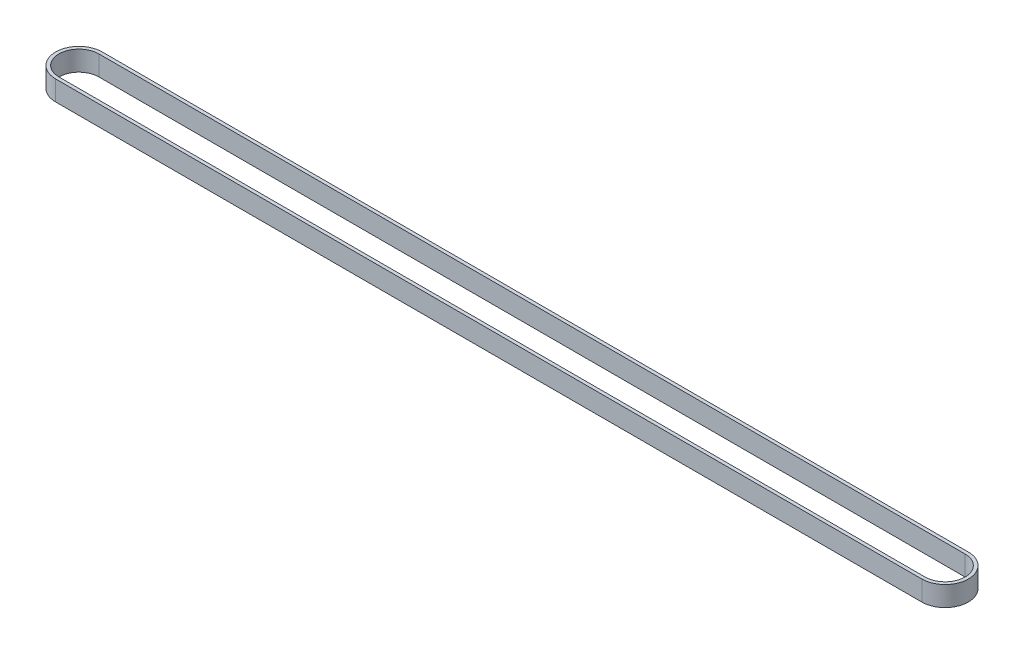
ISO-10303-21;
HEADER;
FILE_DESCRIPTION(('STEP AP214'),'2;1');
FILE_NAME('part.step','',(''),(''),'','','');
FILE_SCHEMA(('AUTOMOTIVE_DESIGN { 1 0 10303 214 1 1 1 1 }'));
ENDSEC;
DATA;
#1=APPLICATION_CONTEXT('core data for automotive mechanical design processes');
#2=APPLICATION_PROTOCOL_DEFINITION('international standard','automotive_design',2000,#1);
#3=PRODUCT_CONTEXT('',#1,'mechanical');
#4=PRODUCT('Part','Part','',(#3));
#5=PRODUCT_RELATED_PRODUCT_CATEGORY('part','',(#4));
#6=PRODUCT_DEFINITION_FORMATION('','',#4);
#7=PRODUCT_DEFINITION_CONTEXT('part definition',#1,'design');
#8=PRODUCT_DEFINITION('design','',#6,#7);
#9=PRODUCT_DEFINITION_SHAPE('','',#8);
#10=(LENGTH_UNIT() NAMED_UNIT(*) SI_UNIT(.MILLI.,.METRE.));
#11=(NAMED_UNIT(*) PLANE_ANGLE_UNIT() SI_UNIT($,.RADIAN.));
#12=(NAMED_UNIT(*) SI_UNIT($,.STERADIAN.) SOLID_ANGLE_UNIT());
#13=UNCERTAINTY_MEASURE_WITH_UNIT(LENGTH_MEASURE(1.E-05),#10,'distance_accuracy_value','');
#14=(GEOMETRIC_REPRESENTATION_CONTEXT(3) GLOBAL_UNCERTAINTY_ASSIGNED_CONTEXT((#13)) GLOBAL_UNIT_ASSIGNED_CONTEXT((#10,
#11,#12)) REPRESENTATION_CONTEXT('',''));
#15=CARTESIAN_POINT('',(0.,0.,0.));
#16=DIRECTION('',(0.,0.,1.));
#17=DIRECTION('',(1.,0.,0.));
#18=AXIS2_PLACEMENT_3D('',#15,#16,#17);
#19=CARTESIAN_POINT('',(0.,6.,0.));
#20=DIRECTION('',(0.,1.,0.));
#21=DIRECTION('',(0.,0.,1.));
#22=AXIS2_PLACEMENT_3D('',#19,#20,#21);
#23=PLANE('',#22);
#24=CARTESIAN_POINT('',(0.,6.,0.));
#25=DIRECTION('',(0.,1.,0.));
#26=DIRECTION('',(0.,0.,1.));
#27=AXIS2_PLACEMENT_3D('',#24,#25,#26);
#28=CIRCLE('',#27,7.);
#29=CARTESIAN_POINT('',(0.,6.,-7.));
#30=VERTEX_POINT('',#29);
#31=CARTESIAN_POINT('',(0.,6.,7.));
#32=VERTEX_POINT('',#31);
#33=EDGE_CURVE('E131',#30,#32,#28,.T.);
#34=ORIENTED_EDGE('',*,*,#33,.T.);
#35=DIRECTION('',(1.,0.,0.));
#36=VECTOR('',#35,1.);
#37=CARTESIAN_POINT('',(0.,6.,7.));
#38=LINE('',#37,#36);
#39=CARTESIAN_POINT('',(260.,6.,7.));
#40=VERTEX_POINT('',#39);
#41=EDGE_CURVE('E134',#32,#40,#38,.T.);
#42=ORIENTED_EDGE('',*,*,#41,.T.);
#43=CARTESIAN_POINT('',(260.,6.,0.));
#44=DIRECTION('',(0.,1.,0.));
#45=DIRECTION('',(0.,0.,1.));
#46=AXIS2_PLACEMENT_3D('',#43,#44,#45);
#47=CIRCLE('',#46,7.);
#48=CARTESIAN_POINT('',(260.,6.,-7.));
#49=VERTEX_POINT('',#48);
#50=EDGE_CURVE('E137',#40,#49,#47,.T.);
#51=ORIENTED_EDGE('',*,*,#50,.T.);
#52=DIRECTION('',(-1.,0.,0.));
#53=VECTOR('',#52,1.);
#54=CARTESIAN_POINT('',(0.,6.,-7.));
#55=LINE('',#54,#53);
#56=EDGE_CURVE('E139',#49,#30,#55,.T.);
#57=ORIENTED_EDGE('',*,*,#56,.T.);
#58=EDGE_LOOP('',(#34,#42,#51,#57));
#59=FACE_BOUND('',#58,.T.);
#60=DIRECTION('',(1.,0.,0.));
#61=VECTOR('',#60,1.);
#62=CARTESIAN_POINT('',(0.,6.,6.));
#63=LINE('',#62,#61);
#64=CARTESIAN_POINT('',(0.,6.,6.));
#65=VERTEX_POINT('',#64);
#66=CARTESIAN_POINT('',(260.,6.,6.));
#67=VERTEX_POINT('',#66);
#68=EDGE_CURVE('E103',#65,#67,#63,.T.);
#69=ORIENTED_EDGE('',*,*,#68,.F.);
#70=CARTESIAN_POINT('',(0.,6.,0.));
#71=DIRECTION('',(0.,1.,0.));
#72=DIRECTION('',(0.,0.,1.));
#73=AXIS2_PLACEMENT_3D('',#70,#71,#72);
#74=CIRCLE('',#73,6.);
#75=CARTESIAN_POINT('',(0.,6.,-6.));
#76=VERTEX_POINT('',#75);
#77=EDGE_CURVE('E95',#76,#65,#74,.T.);
#78=ORIENTED_EDGE('',*,*,#77,.F.);
#79=DIRECTION('',(-1.,0.,0.));
#80=VECTOR('',#79,1.);
#81=CARTESIAN_POINT('',(0.,6.,-6.));
#82=LINE('',#81,#80);
#83=CARTESIAN_POINT('',(260.,6.,-6.));
#84=VERTEX_POINT('',#83);
#85=EDGE_CURVE('E117',#84,#76,#82,.T.);
#86=ORIENTED_EDGE('',*,*,#85,.F.);
#87=CARTESIAN_POINT('',(260.,6.,0.));
#88=DIRECTION('',(0.,1.,0.));
#89=DIRECTION('',(0.,0.,1.));
#90=AXIS2_PLACEMENT_3D('',#87,#88,#89);
#91=CIRCLE('',#90,6.);
#92=EDGE_CURVE('E115',#67,#84,#91,.T.);
#93=ORIENTED_EDGE('',*,*,#92,.F.);
#94=EDGE_LOOP('',(#69,#78,#86,#93));
#95=FACE_BOUND('',#94,.T.);
#96=ADVANCED_FACE('F30',(#59,#95),#23,.T.);
#97=CARTESIAN_POINT('',(0.,0.,0.));
#98=DIRECTION('',(0.,1.,0.));
#99=DIRECTION('',(0.,0.,1.));
#100=AXIS2_PLACEMENT_3D('',#97,#98,#99);
#101=PLANE('',#100);
#102=CARTESIAN_POINT('',(0.,0.,0.));
#103=DIRECTION('',(0.,1.,0.));
#104=DIRECTION('',(0.,0.,1.));
#105=AXIS2_PLACEMENT_3D('',#102,#103,#104);
#106=CIRCLE('',#105,7.);
#107=CARTESIAN_POINT('',(0.,0.,-7.));
#108=VERTEX_POINT('',#107);
#109=CARTESIAN_POINT('',(0.,0.,7.));
#110=VERTEX_POINT('',#109);
#111=EDGE_CURVE('E111',#108,#110,#106,.T.);
#112=ORIENTED_EDGE('',*,*,#111,.F.);
#113=DIRECTION('',(-1.,0.,0.));
#114=VECTOR('',#113,1.);
#115=CARTESIAN_POINT('',(0.,0.,-7.));
#116=LINE('',#115,#114);
#117=CARTESIAN_POINT('',(260.,0.,-7.));
#118=VERTEX_POINT('',#117);
#119=EDGE_CURVE('E135',#118,#108,#116,.T.);
#120=ORIENTED_EDGE('',*,*,#119,.F.);
#121=CARTESIAN_POINT('',(260.,0.,0.));
#122=DIRECTION('',(0.,1.,0.));
#123=DIRECTION('',(0.,0.,1.));
#124=AXIS2_PLACEMENT_3D('',#121,#122,#123);
#125=CIRCLE('',#124,7.);
#126=CARTESIAN_POINT('',(260.,0.,7.));
#127=VERTEX_POINT('',#126);
#128=EDGE_CURVE('E146',#127,#118,#125,.T.);
#129=ORIENTED_EDGE('',*,*,#128,.F.);
#130=DIRECTION('',(1.,0.,0.));
#131=VECTOR('',#130,1.);
#132=CARTESIAN_POINT('',(0.,0.,7.));
#133=LINE('',#132,#131);
#134=EDGE_CURVE('E144',#110,#127,#133,.T.);
#135=ORIENTED_EDGE('',*,*,#134,.F.);
#136=EDGE_LOOP('',(#112,#120,#129,#135));
#137=FACE_BOUND('',#136,.T.);
#138=CARTESIAN_POINT('',(0.,0.,0.));
#139=DIRECTION('',(0.,1.,0.));
#140=DIRECTION('',(0.,0.,1.));
#141=AXIS2_PLACEMENT_3D('',#138,#139,#140);
#142=CIRCLE('',#141,6.);
#143=CARTESIAN_POINT('',(0.,0.,-6.));
#144=VERTEX_POINT('',#143);
#145=CARTESIAN_POINT('',(0.,0.,6.));
#146=VERTEX_POINT('',#145);
#147=EDGE_CURVE('E53',#144,#146,#142,.T.);
#148=ORIENTED_EDGE('',*,*,#147,.T.);
#149=DIRECTION('',(1.,0.,0.));
#150=VECTOR('',#149,1.);
#151=CARTESIAN_POINT('',(0.,0.,6.));
#152=LINE('',#151,#150);
#153=CARTESIAN_POINT('',(260.,0.,6.));
#154=VERTEX_POINT('',#153);
#155=EDGE_CURVE('E110',#146,#154,#152,.T.);
#156=ORIENTED_EDGE('',*,*,#155,.T.);
#157=CARTESIAN_POINT('',(260.,0.,0.));
#158=DIRECTION('',(0.,1.,0.));
#159=DIRECTION('',(0.,0.,1.));
#160=AXIS2_PLACEMENT_3D('',#157,#158,#159);
#161=CIRCLE('',#160,6.);
#162=CARTESIAN_POINT('',(260.,0.,-6.));
#163=VERTEX_POINT('',#162);
#164=EDGE_CURVE('E123',#154,#163,#161,.T.);
#165=ORIENTED_EDGE('',*,*,#164,.T.);
#166=DIRECTION('',(-1.,0.,0.));
#167=VECTOR('',#166,1.);
#168=CARTESIAN_POINT('',(0.,0.,-6.));
#169=LINE('',#168,#167);
#170=EDGE_CURVE('E104',#163,#144,#169,.T.);
#171=ORIENTED_EDGE('',*,*,#170,.T.);
#172=EDGE_LOOP('',(#148,#156,#165,#171));
#173=FACE_BOUND('',#172,.T.);
#174=ADVANCED_FACE('F164',(#137,#173),#101,.F.);
#175=CARTESIAN_POINT('',(0.,6.,0.));
#176=DIRECTION('',(0.,-1.,0.));
#177=DIRECTION('',(0.,0.,-1.));
#178=AXIS2_PLACEMENT_3D('',#175,#176,#177);
#179=CYLINDRICAL_SURFACE('',#178,7.);
#180=ORIENTED_EDGE('',*,*,#111,.T.);
#181=DIRECTION('',(0.,-1.,0.));
#182=VECTOR('',#181,1.);
#183=CARTESIAN_POINT('',(0.,6.,7.));
#184=LINE('',#183,#182);
#185=EDGE_CURVE('E11',#32,#110,#184,.T.);
#186=ORIENTED_EDGE('',*,*,#185,.F.);
#187=ORIENTED_EDGE('',*,*,#33,.F.);
#188=DIRECTION('',(0.,-1.,0.));
#189=VECTOR('',#188,1.);
#190=CARTESIAN_POINT('',(0.,6.,-7.));
#191=LINE('',#190,#189);
#192=EDGE_CURVE('E141',#30,#108,#191,.T.);
#193=ORIENTED_EDGE('',*,*,#192,.T.);
#194=EDGE_LOOP('',(#180,#186,#187,#193));
#195=FACE_BOUND('',#194,.T.);
#196=ADVANCED_FACE('F32',(#195),#179,.T.);
#197=CARTESIAN_POINT('',(0.,6.,7.));
#198=DIRECTION('',(0.,0.,-1.));
#199=DIRECTION('',(-1.,0.,0.));
#200=AXIS2_PLACEMENT_3D('',#197,#198,#199);
#201=PLANE('',#200);
#202=ORIENTED_EDGE('',*,*,#134,.T.);
#203=DIRECTION('',(0.,-1.,0.));
#204=VECTOR('',#203,1.);
#205=CARTESIAN_POINT('',(260.,6.,7.));
#206=LINE('',#205,#204);
#207=EDGE_CURVE('E38',#40,#127,#206,.T.);
#208=ORIENTED_EDGE('',*,*,#207,.F.);
#209=ORIENTED_EDGE('',*,*,#41,.F.);
#210=ORIENTED_EDGE('',*,*,#185,.T.);
#211=EDGE_LOOP('',(#202,#208,#209,#210));
#212=FACE_BOUND('',#211,.T.);
#213=ADVANCED_FACE('F174',(#212),#201,.F.);
#214=CARTESIAN_POINT('',(260.,6.,0.));
#215=DIRECTION('',(0.,-1.,0.));
#216=DIRECTION('',(0.,0.,-1.));
#217=AXIS2_PLACEMENT_3D('',#214,#215,#216);
#218=CYLINDRICAL_SURFACE('',#217,7.);
#219=ORIENTED_EDGE('',*,*,#128,.T.);
#220=DIRECTION('',(0.,-1.,0.));
#221=VECTOR('',#220,1.);
#222=CARTESIAN_POINT('',(260.,6.,-7.));
#223=LINE('',#222,#221);
#224=EDGE_CURVE('E151',#49,#118,#223,.T.);
#225=ORIENTED_EDGE('',*,*,#224,.F.);
#226=ORIENTED_EDGE('',*,*,#50,.F.);
#227=ORIENTED_EDGE('',*,*,#207,.T.);
#228=EDGE_LOOP('',(#219,#225,#226,#227));
#229=FACE_BOUND('',#228,.T.);
#230=ADVANCED_FACE('F158',(#229),#218,.T.);
#231=CARTESIAN_POINT('',(0.,6.,-7.));
#232=DIRECTION('',(0.,0.,1.));
#233=DIRECTION('',(1.,0.,0.));
#234=AXIS2_PLACEMENT_3D('',#231,#232,#233);
#235=PLANE('',#234);
#236=ORIENTED_EDGE('',*,*,#119,.T.);
#237=ORIENTED_EDGE('',*,*,#192,.F.);
#238=ORIENTED_EDGE('',*,*,#56,.F.);
#239=ORIENTED_EDGE('',*,*,#224,.T.);
#240=EDGE_LOOP('',(#236,#237,#238,#239));
#241=FACE_BOUND('',#240,.T.);
#242=ADVANCED_FACE('F168',(#241),#235,.F.);
#243=CARTESIAN_POINT('',(0.,6.,0.));
#244=DIRECTION('',(0.,-1.,0.));
#245=DIRECTION('',(0.,0.,-1.));
#246=AXIS2_PLACEMENT_3D('',#243,#244,#245);
#247=CYLINDRICAL_SURFACE('',#246,6.);
#248=ORIENTED_EDGE('',*,*,#147,.F.);
#249=DIRECTION('',(0.,-1.,0.));
#250=VECTOR('',#249,1.);
#251=CARTESIAN_POINT('',(0.,6.,-6.));
#252=LINE('',#251,#250);
#253=EDGE_CURVE('E99',#76,#144,#252,.T.);
#254=ORIENTED_EDGE('',*,*,#253,.F.);
#255=ORIENTED_EDGE('',*,*,#77,.T.);
#256=DIRECTION('',(0.,-1.,0.));
#257=VECTOR('',#256,1.);
#258=CARTESIAN_POINT('',(0.,6.,6.));
#259=LINE('',#258,#257);
#260=EDGE_CURVE('E98',#65,#146,#259,.T.);
#261=ORIENTED_EDGE('',*,*,#260,.T.);
#262=EDGE_LOOP('',(#248,#254,#255,#261));
#263=FACE_BOUND('',#262,.T.);
#264=ADVANCED_FACE('F97',(#263),#247,.F.);
#265=CARTESIAN_POINT('',(0.,6.,6.));
#266=DIRECTION('',(0.,0.,-1.));
#267=DIRECTION('',(-1.,0.,0.));
#268=AXIS2_PLACEMENT_3D('',#265,#266,#267);
#269=PLANE('',#268);
#270=ORIENTED_EDGE('',*,*,#155,.F.);
#271=ORIENTED_EDGE('',*,*,#260,.F.);
#272=ORIENTED_EDGE('',*,*,#68,.T.);
#273=DIRECTION('',(0.,-1.,0.));
#274=VECTOR('',#273,1.);
#275=CARTESIAN_POINT('',(260.,6.,6.));
#276=LINE('',#275,#274);
#277=EDGE_CURVE('E112',#67,#154,#276,.T.);
#278=ORIENTED_EDGE('',*,*,#277,.T.);
#279=EDGE_LOOP('',(#270,#271,#272,#278));
#280=FACE_BOUND('',#279,.T.);
#281=ADVANCED_FACE('F107',(#280),#269,.T.);
#282=CARTESIAN_POINT('',(260.,6.,0.));
#283=DIRECTION('',(0.,-1.,0.));
#284=DIRECTION('',(0.,0.,-1.));
#285=AXIS2_PLACEMENT_3D('',#282,#283,#284);
#286=CYLINDRICAL_SURFACE('',#285,6.);
#287=ORIENTED_EDGE('',*,*,#164,.F.);
#288=ORIENTED_EDGE('',*,*,#277,.F.);
#289=ORIENTED_EDGE('',*,*,#92,.T.);
#290=DIRECTION('',(0.,-1.,0.));
#291=VECTOR('',#290,1.);
#292=CARTESIAN_POINT('',(260.,6.,-6.));
#293=LINE('',#292,#291);
#294=EDGE_CURVE('E45',#84,#163,#293,.T.);
#295=ORIENTED_EDGE('',*,*,#294,.T.);
#296=EDGE_LOOP('',(#287,#288,#289,#295));
#297=FACE_BOUND('',#296,.T.);
#298=ADVANCED_FACE('F197',(#297),#286,.F.);
#299=CARTESIAN_POINT('',(0.,6.,-6.));
#300=DIRECTION('',(0.,0.,1.));
#301=DIRECTION('',(1.,0.,0.));
#302=AXIS2_PLACEMENT_3D('',#299,#300,#301);
#303=PLANE('',#302);
#304=ORIENTED_EDGE('',*,*,#170,.F.);
#305=ORIENTED_EDGE('',*,*,#294,.F.);
#306=ORIENTED_EDGE('',*,*,#85,.T.);
#307=ORIENTED_EDGE('',*,*,#253,.T.);
#308=EDGE_LOOP('',(#304,#305,#306,#307));
#309=FACE_BOUND('',#308,.T.);
#310=ADVANCED_FACE('F201',(#309),#303,.T.);
#311=CLOSED_SHELL('',(#96,#174,#196,#213,#230,#242,#264,#281,#298,#310));
#312=MANIFOLD_SOLID_BREP('B2',#311);
#313=ADVANCED_BREP_SHAPE_REPRESENTATION('',(#18,#312),#14);
#314=SHAPE_DEFINITION_REPRESENTATION(#9,#313);
ENDSEC;
END-ISO-10303-21;
